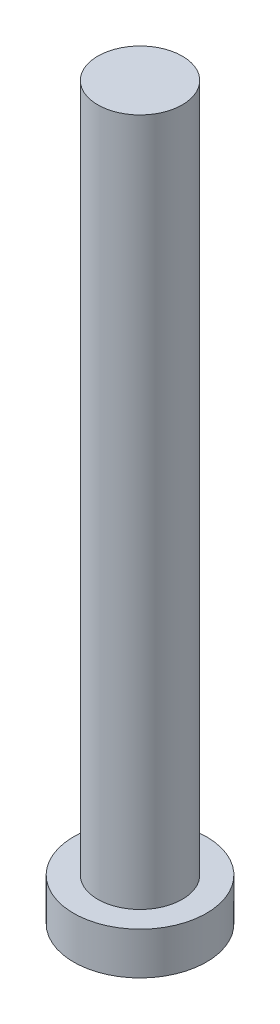
ISO-10303-21;
HEADER;
FILE_DESCRIPTION(('STEP AP214'),'2;1');
FILE_NAME('part.step','',(''),(''),'','','');
FILE_SCHEMA(('AUTOMOTIVE_DESIGN { 1 0 10303 214 1 1 1 1 }'));
ENDSEC;
DATA;
#1=APPLICATION_CONTEXT('core data for automotive mechanical design processes');
#2=APPLICATION_PROTOCOL_DEFINITION('international standard','automotive_design',2000,#1);
#3=PRODUCT_CONTEXT('',#1,'mechanical');
#4=PRODUCT('Part','Part','',(#3));
#5=PRODUCT_RELATED_PRODUCT_CATEGORY('part','',(#4));
#6=PRODUCT_DEFINITION_FORMATION('','',#4);
#7=PRODUCT_DEFINITION_CONTEXT('part definition',#1,'design');
#8=PRODUCT_DEFINITION('design','',#6,#7);
#9=PRODUCT_DEFINITION_SHAPE('','',#8);
#10=(LENGTH_UNIT() NAMED_UNIT(*) SI_UNIT(.MILLI.,.METRE.));
#11=(NAMED_UNIT(*) PLANE_ANGLE_UNIT() SI_UNIT($,.RADIAN.));
#12=(NAMED_UNIT(*) SI_UNIT($,.STERADIAN.) SOLID_ANGLE_UNIT());
#13=UNCERTAINTY_MEASURE_WITH_UNIT(LENGTH_MEASURE(1.E-05),#10,'distance_accuracy_value','');
#14=(GEOMETRIC_REPRESENTATION_CONTEXT(3) GLOBAL_UNCERTAINTY_ASSIGNED_CONTEXT((#13)) GLOBAL_UNIT_ASSIGNED_CONTEXT((#10,
#11,#12)) REPRESENTATION_CONTEXT('',''));
#15=CARTESIAN_POINT('',(0.,0.,0.));
#16=DIRECTION('',(0.,0.,1.));
#17=DIRECTION('',(1.,0.,0.));
#18=AXIS2_PLACEMENT_3D('',#15,#16,#17);
#19=CARTESIAN_POINT('',(0.,121.,0.));
#20=DIRECTION('',(0.,1.,0.));
#21=DIRECTION('',(0.,0.,1.));
#22=AXIS2_PLACEMENT_3D('',#19,#20,#21);
#23=PLANE('',#22);
#24=CARTESIAN_POINT('',(0.,121.,0.));
#25=DIRECTION('',(0.,-1.,0.));
#26=DIRECTION('',(0.,0.,-1.));
#27=AXIS2_PLACEMENT_3D('',#24,#25,#26);
#28=CIRCLE('',#27,7.);
#29=CARTESIAN_POINT('',(0.,121.,-7.));
#30=VERTEX_POINT('',#29);
#31=EDGE_CURVE('E10',#30,#30,#28,.T.);
#32=ORIENTED_EDGE('',*,*,#31,.F.);
#33=EDGE_LOOP('',(#32));
#34=FACE_BOUND('',#33,.T.);
#35=ADVANCED_FACE('F28',(#34),#23,.T.);
#36=CARTESIAN_POINT('',(0.,0.,0.));
#37=DIRECTION('',(0.,-1.,0.));
#38=DIRECTION('',(0.,0.,-1.));
#39=AXIS2_PLACEMENT_3D('',#36,#37,#38);
#40=CYLINDRICAL_SURFACE('',#39,7.00000000000001);
#41=ORIENTED_EDGE('',*,*,#31,.T.);
#42=EDGE_LOOP('',(#41));
#43=FACE_BOUND('',#42,.T.);
#44=CARTESIAN_POINT('',(0.,7.,0.));
#45=DIRECTION('',(0.,-1.,0.));
#46=DIRECTION('',(0.,0.,-1.));
#47=AXIS2_PLACEMENT_3D('',#44,#45,#46);
#48=CIRCLE('',#47,7.00000000000001);
#49=CARTESIAN_POINT('',(0.,7.,-7.00000000000001));
#50=VERTEX_POINT('',#49);
#51=EDGE_CURVE('E34',#50,#50,#48,.T.);
#52=ORIENTED_EDGE('',*,*,#51,.F.);
#53=EDGE_LOOP('',(#52));
#54=FACE_BOUND('',#53,.T.);
#55=ADVANCED_FACE('F60',(#43,#54),#40,.T.);
#56=CARTESIAN_POINT('',(7.00000000000001,7.,0.));
#57=DIRECTION('',(0.,1.,0.));
#58=DIRECTION('',(0.,0.,1.));
#59=AXIS2_PLACEMENT_3D('',#56,#57,#58);
#60=PLANE('',#59);
#61=ORIENTED_EDGE('',*,*,#51,.T.);
#62=EDGE_LOOP('',(#61));
#63=FACE_BOUND('',#62,.T.);
#64=CARTESIAN_POINT('',(0.,7.,0.));
#65=DIRECTION('',(0.,-1.,0.));
#66=DIRECTION('',(0.,0.,-1.));
#67=AXIS2_PLACEMENT_3D('',#64,#65,#66);
#68=CIRCLE('',#67,11.);
#69=CARTESIAN_POINT('',(0.,7.,-11.));
#70=VERTEX_POINT('',#69);
#71=EDGE_CURVE('E38',#70,#70,#68,.T.);
#72=ORIENTED_EDGE('',*,*,#71,.F.);
#73=EDGE_LOOP('',(#72));
#74=FACE_BOUND('',#73,.T.);
#75=ADVANCED_FACE('F52',(#63,#74),#60,.T.);
#76=CARTESIAN_POINT('',(0.,0.,0.));
#77=DIRECTION('',(0.,-1.,0.));
#78=DIRECTION('',(0.,0.,-1.));
#79=AXIS2_PLACEMENT_3D('',#76,#77,#78);
#80=CYLINDRICAL_SURFACE('',#79,11.);
#81=ORIENTED_EDGE('',*,*,#71,.T.);
#82=EDGE_LOOP('',(#81));
#83=FACE_BOUND('',#82,.T.);
#84=CARTESIAN_POINT('',(0.,0.,0.));
#85=DIRECTION('',(0.,-1.,0.));
#86=DIRECTION('',(0.,0.,-1.));
#87=AXIS2_PLACEMENT_3D('',#84,#85,#86);
#88=CIRCLE('',#87,11.);
#89=CARTESIAN_POINT('',(0.,0.,-11.));
#90=VERTEX_POINT('',#89);
#91=EDGE_CURVE('E42',#90,#90,#88,.T.);
#92=ORIENTED_EDGE('',*,*,#91,.F.);
#93=EDGE_LOOP('',(#92));
#94=FACE_BOUND('',#93,.T.);
#95=ADVANCED_FACE('F50',(#83,#94),#80,.T.);
#96=CARTESIAN_POINT('',(11.,0.,0.));
#97=DIRECTION('',(0.,-1.,0.));
#98=DIRECTION('',(0.,0.,-1.));
#99=AXIS2_PLACEMENT_3D('',#96,#97,#98);
#100=PLANE('',#99);
#101=ORIENTED_EDGE('',*,*,#91,.T.);
#102=EDGE_LOOP('',(#101));
#103=FACE_BOUND('',#102,.T.);
#104=ADVANCED_FACE('F48',(#103),#100,.T.);
#105=CLOSED_SHELL('',(#35,#55,#75,#95,#104));
#106=MANIFOLD_SOLID_BREP('B2',#105);
#107=ADVANCED_BREP_SHAPE_REPRESENTATION('',(#18,#106),#14);
#108=SHAPE_DEFINITION_REPRESENTATION(#9,#107);
ENDSEC;
END-ISO-10303-21;
